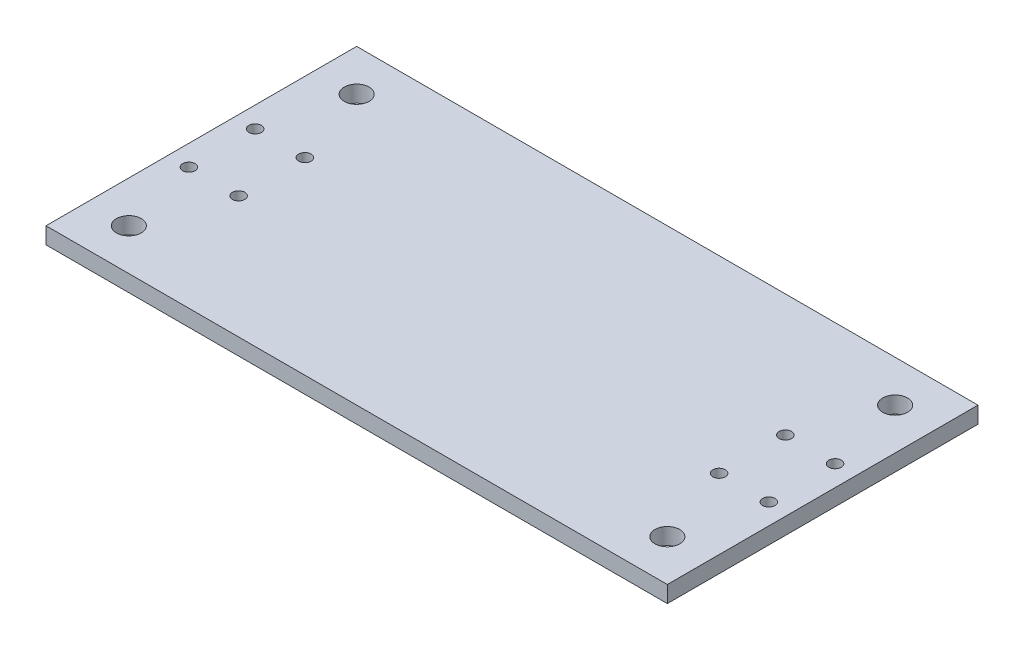
ISO-10303-21;
HEADER;
FILE_DESCRIPTION(('STEP AP214'),'2;1');
FILE_NAME('part.step','',(''),(''),'','','');
FILE_SCHEMA(('AUTOMOTIVE_DESIGN { 1 0 10303 214 1 1 1 1 }'));
ENDSEC;
DATA;
#1=APPLICATION_CONTEXT('core data for automotive mechanical design processes');
#2=APPLICATION_PROTOCOL_DEFINITION('international standard','automotive_design',2000,#1);
#3=PRODUCT_CONTEXT('',#1,'mechanical');
#4=PRODUCT('Part','Part','',(#3));
#5=PRODUCT_RELATED_PRODUCT_CATEGORY('part','',(#4));
#6=PRODUCT_DEFINITION_FORMATION('','',#4);
#7=PRODUCT_DEFINITION_CONTEXT('part definition',#1,'design');
#8=PRODUCT_DEFINITION('design','',#6,#7);
#9=PRODUCT_DEFINITION_SHAPE('','',#8);
#10=(LENGTH_UNIT() NAMED_UNIT(*) SI_UNIT(.MILLI.,.METRE.));
#11=(NAMED_UNIT(*) PLANE_ANGLE_UNIT() SI_UNIT($,.RADIAN.));
#12=(NAMED_UNIT(*) SI_UNIT($,.STERADIAN.) SOLID_ANGLE_UNIT());
#13=UNCERTAINTY_MEASURE_WITH_UNIT(LENGTH_MEASURE(1.E-05),#10,'distance_accuracy_value','');
#14=(GEOMETRIC_REPRESENTATION_CONTEXT(3) GLOBAL_UNCERTAINTY_ASSIGNED_CONTEXT((#13)) GLOBAL_UNIT_ASSIGNED_CONTEXT((#10,
#11,#12)) REPRESENTATION_CONTEXT('',''));
#15=CARTESIAN_POINT('',(0.,0.,0.));
#16=DIRECTION('',(0.,0.,1.));
#17=DIRECTION('',(1.,0.,0.));
#18=AXIS2_PLACEMENT_3D('',#15,#16,#17);
#19=CARTESIAN_POINT('',(0.,4.,0.));
#20=DIRECTION('',(0.,-1.,0.));
#21=DIRECTION('',(0.,0.,-1.));
#22=AXIS2_PLACEMENT_3D('',#19,#20,#21);
#23=PLANE('',#22);
#24=DIRECTION('',(0.,0.,-1.));
#25=VECTOR('',#24,1.);
#26=CARTESIAN_POINT('',(75.,4.,37.5));
#27=LINE('',#26,#25);
#28=CARTESIAN_POINT('',(75.,4.,37.5));
#29=VERTEX_POINT('',#28);
#30=CARTESIAN_POINT('',(75.,4.,-37.5));
#31=VERTEX_POINT('',#30);
#32=EDGE_CURVE('E92',#29,#31,#27,.T.);
#33=ORIENTED_EDGE('',*,*,#32,.T.);
#34=DIRECTION('',(-1.,0.,0.));
#35=VECTOR('',#34,1.);
#36=CARTESIAN_POINT('',(-75.,4.,-37.5));
#37=LINE('',#36,#35);
#38=CARTESIAN_POINT('',(-75.,4.,-37.5));
#39=VERTEX_POINT('',#38);
#40=EDGE_CURVE('E87',#31,#39,#37,.T.);
#41=ORIENTED_EDGE('',*,*,#40,.T.);
#42=DIRECTION('',(0.,0.,1.));
#43=VECTOR('',#42,1.);
#44=CARTESIAN_POINT('',(-75.,4.,37.5));
#45=LINE('',#44,#43);
#46=CARTESIAN_POINT('',(-75.,4.,37.5));
#47=VERTEX_POINT('',#46);
#48=EDGE_CURVE('E90',#39,#47,#45,.T.);
#49=ORIENTED_EDGE('',*,*,#48,.T.);
#50=DIRECTION('',(1.,0.,0.));
#51=VECTOR('',#50,1.);
#52=CARTESIAN_POINT('',(-75.,4.,37.5));
#53=LINE('',#52,#51);
#54=EDGE_CURVE('E57',#47,#29,#53,.T.);
#55=ORIENTED_EDGE('',*,*,#54,.T.);
#56=EDGE_LOOP('',(#33,#41,#49,#55));
#57=FACE_BOUND('',#56,.T.);
#58=CARTESIAN_POINT('',(-65.,4.,-27.5));
#59=DIRECTION('',(0.,1.,0.));
#60=DIRECTION('',(0.,0.,1.));
#61=AXIS2_PLACEMENT_3D('',#58,#59,#60);
#62=CIRCLE('',#61,3.);
#63=CARTESIAN_POINT('',(-65.,4.,-24.5));
#64=VERTEX_POINT('',#63);
#65=EDGE_CURVE('E112',#64,#64,#62,.T.);
#66=ORIENTED_EDGE('',*,*,#65,.F.);
#67=EDGE_LOOP('',(#66));
#68=FACE_BOUND('',#67,.T.);
#69=CARTESIAN_POINT('',(-70.,4.,-8.));
#70=DIRECTION('',(0.,1.,0.));
#71=DIRECTION('',(0.,0.,1.));
#72=AXIS2_PLACEMENT_3D('',#69,#70,#71);
#73=CIRCLE('',#72,1.5);
#74=CARTESIAN_POINT('',(-70.,4.,-6.5));
#75=VERTEX_POINT('',#74);
#76=EDGE_CURVE('E134',#75,#75,#73,.T.);
#77=ORIENTED_EDGE('',*,*,#76,.F.);
#78=EDGE_LOOP('',(#77));
#79=FACE_BOUND('',#78,.T.);
#80=CARTESIAN_POINT('',(-70.,4.,7.99999999999999));
#81=DIRECTION('',(0.,1.,0.));
#82=DIRECTION('',(0.,0.,-1.));
#83=AXIS2_PLACEMENT_3D('',#80,#81,#82);
#84=CIRCLE('',#83,1.5);
#85=CARTESIAN_POINT('',(-70.,4.,6.49999999999999));
#86=VERTEX_POINT('',#85);
#87=EDGE_CURVE('E142',#86,#86,#84,.T.);
#88=ORIENTED_EDGE('',*,*,#87,.F.);
#89=EDGE_LOOP('',(#88));
#90=FACE_BOUND('',#89,.T.);
#91=CARTESIAN_POINT('',(-58.,4.,7.99999999999999));
#92=DIRECTION('',(0.,1.,0.));
#93=DIRECTION('',(0.,0.,1.));
#94=AXIS2_PLACEMENT_3D('',#91,#92,#93);
#95=CIRCLE('',#94,1.5);
#96=CARTESIAN_POINT('',(-58.,4.,9.49999999999998));
#97=VERTEX_POINT('',#96);
#98=EDGE_CURVE('E150',#97,#97,#95,.T.);
#99=ORIENTED_EDGE('',*,*,#98,.F.);
#100=EDGE_LOOP('',(#99));
#101=FACE_BOUND('',#100,.T.);
#102=CARTESIAN_POINT('',(-58.,4.,-8.));
#103=DIRECTION('',(0.,1.,0.));
#104=DIRECTION('',(0.,0.,-1.));
#105=AXIS2_PLACEMENT_3D('',#102,#103,#104);
#106=CIRCLE('',#105,1.5);
#107=CARTESIAN_POINT('',(-58.,4.,-9.5));
#108=VERTEX_POINT('',#107);
#109=EDGE_CURVE('E158',#108,#108,#106,.T.);
#110=ORIENTED_EDGE('',*,*,#109,.F.);
#111=EDGE_LOOP('',(#110));
#112=FACE_BOUND('',#111,.T.);
#113=CARTESIAN_POINT('',(58.,4.,7.99999999999999));
#114=DIRECTION('',(0.,1.,0.));
#115=DIRECTION('',(0.,0.,-1.));
#116=AXIS2_PLACEMENT_3D('',#113,#114,#115);
#117=CIRCLE('',#116,1.5);
#118=CARTESIAN_POINT('',(58.,4.,6.49999999999999));
#119=VERTEX_POINT('',#118);
#120=EDGE_CURVE('E166',#119,#119,#117,.T.);
#121=ORIENTED_EDGE('',*,*,#120,.F.);
#122=EDGE_LOOP('',(#121));
#123=FACE_BOUND('',#122,.T.);
#124=CARTESIAN_POINT('',(70.,4.,7.99999999999999));
#125=DIRECTION('',(0.,1.,0.));
#126=DIRECTION('',(0.,0.,1.));
#127=AXIS2_PLACEMENT_3D('',#124,#125,#126);
#128=CIRCLE('',#127,1.5);
#129=CARTESIAN_POINT('',(70.,4.,9.49999999999998));
#130=VERTEX_POINT('',#129);
#131=EDGE_CURVE('E174',#130,#130,#128,.T.);
#132=ORIENTED_EDGE('',*,*,#131,.F.);
#133=EDGE_LOOP('',(#132));
#134=FACE_BOUND('',#133,.T.);
#135=CARTESIAN_POINT('',(58.,4.,-8.));
#136=DIRECTION('',(0.,1.,0.));
#137=DIRECTION('',(0.,0.,1.));
#138=AXIS2_PLACEMENT_3D('',#135,#136,#137);
#139=CIRCLE('',#138,1.5);
#140=CARTESIAN_POINT('',(58.,4.,-6.5));
#141=VERTEX_POINT('',#140);
#142=EDGE_CURVE('E182',#141,#141,#139,.T.);
#143=ORIENTED_EDGE('',*,*,#142,.F.);
#144=EDGE_LOOP('',(#143));
#145=FACE_BOUND('',#144,.T.);
#146=CARTESIAN_POINT('',(70.,4.,-8.));
#147=DIRECTION('',(0.,1.,0.));
#148=DIRECTION('',(0.,0.,-1.));
#149=AXIS2_PLACEMENT_3D('',#146,#147,#148);
#150=CIRCLE('',#149,1.5);
#151=CARTESIAN_POINT('',(70.,4.,-9.5));
#152=VERTEX_POINT('',#151);
#153=EDGE_CURVE('E190',#152,#152,#150,.T.);
#154=ORIENTED_EDGE('',*,*,#153,.F.);
#155=EDGE_LOOP('',(#154));
#156=FACE_BOUND('',#155,.T.);
#157=CARTESIAN_POINT('',(65.,4.,-27.5));
#158=DIRECTION('',(0.,1.,0.));
#159=DIRECTION('',(0.,0.,-1.));
#160=AXIS2_PLACEMENT_3D('',#157,#158,#159);
#161=CIRCLE('',#160,3.00000000000001);
#162=CARTESIAN_POINT('',(65.,4.,-30.5));
#163=VERTEX_POINT('',#162);
#164=EDGE_CURVE('E198',#163,#163,#161,.T.);
#165=ORIENTED_EDGE('',*,*,#164,.F.);
#166=EDGE_LOOP('',(#165));
#167=FACE_BOUND('',#166,.T.);
#168=CARTESIAN_POINT('',(-65.,4.,27.5));
#169=DIRECTION('',(0.,1.,0.));
#170=DIRECTION('',(0.,0.,-1.));
#171=AXIS2_PLACEMENT_3D('',#168,#169,#170);
#172=CIRCLE('',#171,3.);
#173=CARTESIAN_POINT('',(-65.,4.,24.5));
#174=VERTEX_POINT('',#173);
#175=EDGE_CURVE('E206',#174,#174,#172,.T.);
#176=ORIENTED_EDGE('',*,*,#175,.F.);
#177=EDGE_LOOP('',(#176));
#178=FACE_BOUND('',#177,.T.);
#179=CARTESIAN_POINT('',(65.,4.,27.5));
#180=DIRECTION('',(0.,1.,0.));
#181=DIRECTION('',(0.,0.,1.));
#182=AXIS2_PLACEMENT_3D('',#179,#180,#181);
#183=CIRCLE('',#182,3.00000000000001);
#184=CARTESIAN_POINT('',(65.,4.,30.5));
#185=VERTEX_POINT('',#184);
#186=EDGE_CURVE('E214',#185,#185,#183,.T.);
#187=ORIENTED_EDGE('',*,*,#186,.F.);
#188=EDGE_LOOP('',(#187));
#189=FACE_BOUND('',#188,.T.);
#190=ADVANCED_FACE('F39',(#57,#68,#79,#90,#101,#112,#123,#134,#145,#156,#167,#178,#189),#23,.F.);
#191=CARTESIAN_POINT('',(0.,0.,0.));
#192=DIRECTION('',(0.,-1.,0.));
#193=DIRECTION('',(0.,0.,-1.));
#194=AXIS2_PLACEMENT_3D('',#191,#192,#193);
#195=PLANE('',#194);
#196=CARTESIAN_POINT('',(-65.,0.,27.5));
#197=DIRECTION('',(0.,1.,0.));
#198=DIRECTION('',(0.,0.,-1.));
#199=AXIS2_PLACEMENT_3D('',#196,#197,#198);
#200=CIRCLE('',#199,3.);
#201=CARTESIAN_POINT('',(-65.,0.,24.5));
#202=VERTEX_POINT('',#201);
#203=EDGE_CURVE('E210',#202,#202,#200,.T.);
#204=ORIENTED_EDGE('',*,*,#203,.T.);
#205=EDGE_LOOP('',(#204));
#206=FACE_BOUND('',#205,.T.);
#207=CARTESIAN_POINT('',(70.,0.,-8.));
#208=DIRECTION('',(0.,1.,0.));
#209=DIRECTION('',(0.,0.,-1.));
#210=AXIS2_PLACEMENT_3D('',#207,#208,#209);
#211=CIRCLE('',#210,1.5);
#212=CARTESIAN_POINT('',(70.,0.,-9.5));
#213=VERTEX_POINT('',#212);
#214=EDGE_CURVE('E194',#213,#213,#211,.T.);
#215=ORIENTED_EDGE('',*,*,#214,.T.);
#216=EDGE_LOOP('',(#215));
#217=FACE_BOUND('',#216,.T.);
#218=CARTESIAN_POINT('',(70.,0.,7.99999999999999));
#219=DIRECTION('',(0.,1.,0.));
#220=DIRECTION('',(0.,0.,1.));
#221=AXIS2_PLACEMENT_3D('',#218,#219,#220);
#222=CIRCLE('',#221,1.5);
#223=CARTESIAN_POINT('',(70.,0.,9.49999999999998));
#224=VERTEX_POINT('',#223);
#225=EDGE_CURVE('E178',#224,#224,#222,.T.);
#226=ORIENTED_EDGE('',*,*,#225,.T.);
#227=EDGE_LOOP('',(#226));
#228=FACE_BOUND('',#227,.T.);
#229=CARTESIAN_POINT('',(-58.,0.,-8.));
#230=DIRECTION('',(0.,1.,0.));
#231=DIRECTION('',(0.,0.,-1.));
#232=AXIS2_PLACEMENT_3D('',#229,#230,#231);
#233=CIRCLE('',#232,1.5);
#234=CARTESIAN_POINT('',(-58.,0.,-9.5));
#235=VERTEX_POINT('',#234);
#236=EDGE_CURVE('E162',#235,#235,#233,.T.);
#237=ORIENTED_EDGE('',*,*,#236,.T.);
#238=EDGE_LOOP('',(#237));
#239=FACE_BOUND('',#238,.T.);
#240=CARTESIAN_POINT('',(-70.,0.,7.99999999999999));
#241=DIRECTION('',(0.,1.,0.));
#242=DIRECTION('',(0.,0.,-1.));
#243=AXIS2_PLACEMENT_3D('',#240,#241,#242);
#244=CIRCLE('',#243,1.5);
#245=CARTESIAN_POINT('',(-70.,0.,6.49999999999999));
#246=VERTEX_POINT('',#245);
#247=EDGE_CURVE('E146',#246,#246,#244,.T.);
#248=ORIENTED_EDGE('',*,*,#247,.T.);
#249=EDGE_LOOP('',(#248));
#250=FACE_BOUND('',#249,.T.);
#251=CARTESIAN_POINT('',(-65.,0.,-27.5));
#252=DIRECTION('',(0.,1.,0.));
#253=DIRECTION('',(0.,0.,1.));
#254=AXIS2_PLACEMENT_3D('',#251,#252,#253);
#255=CIRCLE('',#254,3.);
#256=CARTESIAN_POINT('',(-65.,0.,-24.5));
#257=VERTEX_POINT('',#256);
#258=EDGE_CURVE('E130',#257,#257,#255,.T.);
#259=ORIENTED_EDGE('',*,*,#258,.T.);
#260=EDGE_LOOP('',(#259));
#261=FACE_BOUND('',#260,.T.);
#262=DIRECTION('',(0.,0.,-1.));
#263=VECTOR('',#262,1.);
#264=CARTESIAN_POINT('',(75.,0.,37.5));
#265=LINE('',#264,#263);
#266=CARTESIAN_POINT('',(75.,0.,37.5));
#267=VERTEX_POINT('',#266);
#268=CARTESIAN_POINT('',(75.,0.,-37.5));
#269=VERTEX_POINT('',#268);
#270=EDGE_CURVE('E108',#267,#269,#265,.T.);
#271=ORIENTED_EDGE('',*,*,#270,.F.);
#272=DIRECTION('',(1.,0.,0.));
#273=VECTOR('',#272,1.);
#274=CARTESIAN_POINT('',(-75.,0.,37.5));
#275=LINE('',#274,#273);
#276=CARTESIAN_POINT('',(-75.,0.,37.5));
#277=VERTEX_POINT('',#276);
#278=EDGE_CURVE('E80',#277,#267,#275,.T.);
#279=ORIENTED_EDGE('',*,*,#278,.F.);
#280=DIRECTION('',(0.,0.,1.));
#281=VECTOR('',#280,1.);
#282=CARTESIAN_POINT('',(-75.,0.,37.5));
#283=LINE('',#282,#281);
#284=CARTESIAN_POINT('',(-75.,0.,-37.5));
#285=VERTEX_POINT('',#284);
#286=EDGE_CURVE('E74',#285,#277,#283,.T.);
#287=ORIENTED_EDGE('',*,*,#286,.F.);
#288=DIRECTION('',(-1.,0.,0.));
#289=VECTOR('',#288,1.);
#290=CARTESIAN_POINT('',(-75.,0.,-37.5));
#291=LINE('',#290,#289);
#292=EDGE_CURVE('E97',#269,#285,#291,.T.);
#293=ORIENTED_EDGE('',*,*,#292,.F.);
#294=EDGE_LOOP('',(#271,#279,#287,#293));
#295=FACE_BOUND('',#294,.T.);
#296=CARTESIAN_POINT('',(-70.,0.,-8.));
#297=DIRECTION('',(0.,1.,0.));
#298=DIRECTION('',(0.,0.,1.));
#299=AXIS2_PLACEMENT_3D('',#296,#297,#298);
#300=CIRCLE('',#299,1.5);
#301=CARTESIAN_POINT('',(-70.,0.,-6.5));
#302=VERTEX_POINT('',#301);
#303=EDGE_CURVE('E138',#302,#302,#300,.T.);
#304=ORIENTED_EDGE('',*,*,#303,.T.);
#305=EDGE_LOOP('',(#304));
#306=FACE_BOUND('',#305,.T.);
#307=CARTESIAN_POINT('',(-58.,0.,7.99999999999999));
#308=DIRECTION('',(0.,1.,0.));
#309=DIRECTION('',(0.,0.,1.));
#310=AXIS2_PLACEMENT_3D('',#307,#308,#309);
#311=CIRCLE('',#310,1.5);
#312=CARTESIAN_POINT('',(-58.,0.,9.49999999999998));
#313=VERTEX_POINT('',#312);
#314=EDGE_CURVE('E154',#313,#313,#311,.T.);
#315=ORIENTED_EDGE('',*,*,#314,.T.);
#316=EDGE_LOOP('',(#315));
#317=FACE_BOUND('',#316,.T.);
#318=CARTESIAN_POINT('',(58.,0.,7.99999999999999));
#319=DIRECTION('',(0.,1.,0.));
#320=DIRECTION('',(0.,0.,-1.));
#321=AXIS2_PLACEMENT_3D('',#318,#319,#320);
#322=CIRCLE('',#321,1.5);
#323=CARTESIAN_POINT('',(58.,0.,6.49999999999999));
#324=VERTEX_POINT('',#323);
#325=EDGE_CURVE('E170',#324,#324,#322,.T.);
#326=ORIENTED_EDGE('',*,*,#325,.T.);
#327=EDGE_LOOP('',(#326));
#328=FACE_BOUND('',#327,.T.);
#329=CARTESIAN_POINT('',(58.,0.,-8.));
#330=DIRECTION('',(0.,1.,0.));
#331=DIRECTION('',(0.,0.,1.));
#332=AXIS2_PLACEMENT_3D('',#329,#330,#331);
#333=CIRCLE('',#332,1.5);
#334=CARTESIAN_POINT('',(58.,0.,-6.5));
#335=VERTEX_POINT('',#334);
#336=EDGE_CURVE('E186',#335,#335,#333,.T.);
#337=ORIENTED_EDGE('',*,*,#336,.T.);
#338=EDGE_LOOP('',(#337));
#339=FACE_BOUND('',#338,.T.);
#340=CARTESIAN_POINT('',(65.,0.,-27.5));
#341=DIRECTION('',(0.,1.,0.));
#342=DIRECTION('',(0.,0.,-1.));
#343=AXIS2_PLACEMENT_3D('',#340,#341,#342);
#344=CIRCLE('',#343,3.00000000000001);
#345=CARTESIAN_POINT('',(65.,0.,-30.5));
#346=VERTEX_POINT('',#345);
#347=EDGE_CURVE('E202',#346,#346,#344,.T.);
#348=ORIENTED_EDGE('',*,*,#347,.T.);
#349=EDGE_LOOP('',(#348));
#350=FACE_BOUND('',#349,.T.);
#351=CARTESIAN_POINT('',(65.,0.,27.5));
#352=DIRECTION('',(0.,1.,0.));
#353=DIRECTION('',(0.,0.,1.));
#354=AXIS2_PLACEMENT_3D('',#351,#352,#353);
#355=CIRCLE('',#354,3.00000000000001);
#356=CARTESIAN_POINT('',(65.,0.,30.5));
#357=VERTEX_POINT('',#356);
#358=EDGE_CURVE('E218',#357,#357,#355,.T.);
#359=ORIENTED_EDGE('',*,*,#358,.T.);
#360=EDGE_LOOP('',(#359));
#361=FACE_BOUND('',#360,.T.);
#362=ADVANCED_FACE('F125',(#206,#217,#228,#239,#250,#261,#295,#306,#317,#328,#339,#350,#361),
#195,.T.);
#363=CARTESIAN_POINT('',(75.,4.,37.5));
#364=DIRECTION('',(-1.,0.,0.));
#365=DIRECTION('',(0.,0.,1.));
#366=AXIS2_PLACEMENT_3D('',#363,#364,#365);
#367=PLANE('',#366);
#368=ORIENTED_EDGE('',*,*,#270,.T.);
#369=DIRECTION('',(0.,-1.,0.));
#370=VECTOR('',#369,1.);
#371=CARTESIAN_POINT('',(75.,4.,-37.5));
#372=LINE('',#371,#370);
#373=EDGE_CURVE('E11',#31,#269,#372,.T.);
#374=ORIENTED_EDGE('',*,*,#373,.F.);
#375=ORIENTED_EDGE('',*,*,#32,.F.);
#376=DIRECTION('',(0.,-1.,0.));
#377=VECTOR('',#376,1.);
#378=CARTESIAN_POINT('',(75.,4.,37.5));
#379=LINE('',#378,#377);
#380=EDGE_CURVE('E104',#29,#267,#379,.T.);
#381=ORIENTED_EDGE('',*,*,#380,.T.);
#382=EDGE_LOOP('',(#368,#374,#375,#381));
#383=FACE_BOUND('',#382,.T.);
#384=ADVANCED_FACE('F41',(#383),#367,.F.);
#385=CARTESIAN_POINT('',(-75.,4.,-37.5));
#386=DIRECTION('',(0.,0.,1.));
#387=DIRECTION('',(1.,0.,0.));
#388=AXIS2_PLACEMENT_3D('',#385,#386,#387);
#389=PLANE('',#388);
#390=ORIENTED_EDGE('',*,*,#292,.T.);
#391=DIRECTION('',(0.,-1.,0.));
#392=VECTOR('',#391,1.);
#393=CARTESIAN_POINT('',(-75.,4.,-37.5));
#394=LINE('',#393,#392);
#395=EDGE_CURVE('E49',#39,#285,#394,.T.);
#396=ORIENTED_EDGE('',*,*,#395,.F.);
#397=ORIENTED_EDGE('',*,*,#40,.F.);
#398=ORIENTED_EDGE('',*,*,#373,.T.);
#399=EDGE_LOOP('',(#390,#396,#397,#398));
#400=FACE_BOUND('',#399,.T.);
#401=ADVANCED_FACE('F96',(#400),#389,.F.);
#402=CARTESIAN_POINT('',(-75.,4.,37.5));
#403=DIRECTION('',(1.,0.,0.));
#404=DIRECTION('',(0.,0.,-1.));
#405=AXIS2_PLACEMENT_3D('',#402,#403,#404);
#406=PLANE('',#405);
#407=ORIENTED_EDGE('',*,*,#286,.T.);
#408=DIRECTION('',(0.,-1.,0.));
#409=VECTOR('',#408,1.);
#410=CARTESIAN_POINT('',(-75.,4.,37.5));
#411=LINE('',#410,#409);
#412=EDGE_CURVE('E99',#47,#277,#411,.T.);
#413=ORIENTED_EDGE('',*,*,#412,.F.);
#414=ORIENTED_EDGE('',*,*,#48,.F.);
#415=ORIENTED_EDGE('',*,*,#395,.T.);
#416=EDGE_LOOP('',(#407,#413,#414,#415));
#417=FACE_BOUND('',#416,.T.);
#418=ADVANCED_FACE('F100',(#417),#406,.F.);
#419=CARTESIAN_POINT('',(-75.,4.,37.5));
#420=DIRECTION('',(0.,0.,-1.));
#421=DIRECTION('',(-1.,0.,0.));
#422=AXIS2_PLACEMENT_3D('',#419,#420,#421);
#423=PLANE('',#422);
#424=ORIENTED_EDGE('',*,*,#278,.T.);
#425=ORIENTED_EDGE('',*,*,#380,.F.);
#426=ORIENTED_EDGE('',*,*,#54,.F.);
#427=ORIENTED_EDGE('',*,*,#412,.T.);
#428=EDGE_LOOP('',(#424,#425,#426,#427));
#429=FACE_BOUND('',#428,.T.);
#430=ADVANCED_FACE('F122',(#429),#423,.F.);
#431=CARTESIAN_POINT('',(-65.,4.,-27.5));
#432=DIRECTION('',(0.,-1.,0.));
#433=DIRECTION('',(0.,0.,-1.));
#434=AXIS2_PLACEMENT_3D('',#431,#432,#433);
#435=CYLINDRICAL_SURFACE('',#434,3.);
#436=ORIENTED_EDGE('',*,*,#65,.T.);
#437=EDGE_LOOP('',(#436));
#438=FACE_BOUND('',#437,.T.);
#439=ORIENTED_EDGE('',*,*,#258,.F.);
#440=EDGE_LOOP('',(#439));
#441=FACE_BOUND('',#440,.T.);
#442=ADVANCED_FACE('F237',(#438,#441),#435,.F.);
#443=CARTESIAN_POINT('',(-70.,4.,-8.));
#444=DIRECTION('',(0.,-1.,0.));
#445=DIRECTION('',(0.,0.,-1.));
#446=AXIS2_PLACEMENT_3D('',#443,#444,#445);
#447=CYLINDRICAL_SURFACE('',#446,1.5);
#448=ORIENTED_EDGE('',*,*,#76,.T.);
#449=EDGE_LOOP('',(#448));
#450=FACE_BOUND('',#449,.T.);
#451=ORIENTED_EDGE('',*,*,#303,.F.);
#452=EDGE_LOOP('',(#451));
#453=FACE_BOUND('',#452,.T.);
#454=ADVANCED_FACE('F283',(#450,#453),#447,.F.);
#455=CARTESIAN_POINT('',(-70.,4.,7.99999999999999));
#456=DIRECTION('',(0.,-1.,0.));
#457=DIRECTION('',(0.,0.,-1.));
#458=AXIS2_PLACEMENT_3D('',#455,#456,#457);
#459=CYLINDRICAL_SURFACE('',#458,1.5);
#460=ORIENTED_EDGE('',*,*,#87,.T.);
#461=EDGE_LOOP('',(#460));
#462=FACE_BOUND('',#461,.T.);
#463=ORIENTED_EDGE('',*,*,#247,.F.);
#464=EDGE_LOOP('',(#463));
#465=FACE_BOUND('',#464,.T.);
#466=ADVANCED_FACE('F291',(#462,#465),#459,.F.);
#467=CARTESIAN_POINT('',(-58.,4.,7.99999999999999));
#468=DIRECTION('',(0.,-1.,0.));
#469=DIRECTION('',(0.,0.,-1.));
#470=AXIS2_PLACEMENT_3D('',#467,#468,#469);
#471=CYLINDRICAL_SURFACE('',#470,1.5);
#472=ORIENTED_EDGE('',*,*,#98,.T.);
#473=EDGE_LOOP('',(#472));
#474=FACE_BOUND('',#473,.T.);
#475=ORIENTED_EDGE('',*,*,#314,.F.);
#476=EDGE_LOOP('',(#475));
#477=FACE_BOUND('',#476,.T.);
#478=ADVANCED_FACE('F299',(#474,#477),#471,.F.);
#479=CARTESIAN_POINT('',(-58.,4.,-8.));
#480=DIRECTION('',(0.,-1.,0.));
#481=DIRECTION('',(0.,0.,-1.));
#482=AXIS2_PLACEMENT_3D('',#479,#480,#481);
#483=CYLINDRICAL_SURFACE('',#482,1.5);
#484=ORIENTED_EDGE('',*,*,#109,.T.);
#485=EDGE_LOOP('',(#484));
#486=FACE_BOUND('',#485,.T.);
#487=ORIENTED_EDGE('',*,*,#236,.F.);
#488=EDGE_LOOP('',(#487));
#489=FACE_BOUND('',#488,.T.);
#490=ADVANCED_FACE('F308',(#486,#489),#483,.F.);
#491=CARTESIAN_POINT('',(58.,4.,7.99999999999999));
#492=DIRECTION('',(0.,-1.,0.));
#493=DIRECTION('',(0.,0.,-1.));
#494=AXIS2_PLACEMENT_3D('',#491,#492,#493);
#495=CYLINDRICAL_SURFACE('',#494,1.5);
#496=ORIENTED_EDGE('',*,*,#120,.T.);
#497=EDGE_LOOP('',(#496));
#498=FACE_BOUND('',#497,.T.);
#499=ORIENTED_EDGE('',*,*,#325,.F.);
#500=EDGE_LOOP('',(#499));
#501=FACE_BOUND('',#500,.T.);
#502=ADVANCED_FACE('F317',(#498,#501),#495,.F.);
#503=CARTESIAN_POINT('',(70.,4.,7.99999999999999));
#504=DIRECTION('',(0.,-1.,0.));
#505=DIRECTION('',(0.,0.,-1.));
#506=AXIS2_PLACEMENT_3D('',#503,#504,#505);
#507=CYLINDRICAL_SURFACE('',#506,1.5);
#508=ORIENTED_EDGE('',*,*,#131,.T.);
#509=EDGE_LOOP('',(#508));
#510=FACE_BOUND('',#509,.T.);
#511=ORIENTED_EDGE('',*,*,#225,.F.);
#512=EDGE_LOOP('',(#511));
#513=FACE_BOUND('',#512,.T.);
#514=ADVANCED_FACE('F326',(#510,#513),#507,.F.);
#515=CARTESIAN_POINT('',(58.,4.,-8.));
#516=DIRECTION('',(0.,-1.,0.));
#517=DIRECTION('',(0.,0.,-1.));
#518=AXIS2_PLACEMENT_3D('',#515,#516,#517);
#519=CYLINDRICAL_SURFACE('',#518,1.5);
#520=ORIENTED_EDGE('',*,*,#142,.T.);
#521=EDGE_LOOP('',(#520));
#522=FACE_BOUND('',#521,.T.);
#523=ORIENTED_EDGE('',*,*,#336,.F.);
#524=EDGE_LOOP('',(#523));
#525=FACE_BOUND('',#524,.T.);
#526=ADVANCED_FACE('F335',(#522,#525),#519,.F.);
#527=CARTESIAN_POINT('',(70.,4.,-8.));
#528=DIRECTION('',(0.,-1.,0.));
#529=DIRECTION('',(0.,0.,-1.));
#530=AXIS2_PLACEMENT_3D('',#527,#528,#529);
#531=CYLINDRICAL_SURFACE('',#530,1.5);
#532=ORIENTED_EDGE('',*,*,#153,.T.);
#533=EDGE_LOOP('',(#532));
#534=FACE_BOUND('',#533,.T.);
#535=ORIENTED_EDGE('',*,*,#214,.F.);
#536=EDGE_LOOP('',(#535));
#537=FACE_BOUND('',#536,.T.);
#538=ADVANCED_FACE('F344',(#534,#537),#531,.F.);
#539=CARTESIAN_POINT('',(65.,4.,-27.5));
#540=DIRECTION('',(0.,-1.,0.));
#541=DIRECTION('',(0.,0.,-1.));
#542=AXIS2_PLACEMENT_3D('',#539,#540,#541);
#543=CYLINDRICAL_SURFACE('',#542,3.00000000000001);
#544=ORIENTED_EDGE('',*,*,#164,.T.);
#545=EDGE_LOOP('',(#544));
#546=FACE_BOUND('',#545,.T.);
#547=ORIENTED_EDGE('',*,*,#347,.F.);
#548=EDGE_LOOP('',(#547));
#549=FACE_BOUND('',#548,.T.);
#550=ADVANCED_FACE('F353',(#546,#549),#543,.F.);
#551=CARTESIAN_POINT('',(-65.,4.,27.5));
#552=DIRECTION('',(0.,-1.,0.));
#553=DIRECTION('',(0.,0.,-1.));
#554=AXIS2_PLACEMENT_3D('',#551,#552,#553);
#555=CYLINDRICAL_SURFACE('',#554,3.);
#556=ORIENTED_EDGE('',*,*,#175,.T.);
#557=EDGE_LOOP('',(#556));
#558=FACE_BOUND('',#557,.T.);
#559=ORIENTED_EDGE('',*,*,#203,.F.);
#560=EDGE_LOOP('',(#559));
#561=FACE_BOUND('',#560,.T.);
#562=ADVANCED_FACE('F362',(#558,#561),#555,.F.);
#563=CARTESIAN_POINT('',(65.,4.,27.5));
#564=DIRECTION('',(0.,-1.,0.));
#565=DIRECTION('',(0.,0.,-1.));
#566=AXIS2_PLACEMENT_3D('',#563,#564,#565);
#567=CYLINDRICAL_SURFACE('',#566,3.00000000000001);
#568=ORIENTED_EDGE('',*,*,#186,.T.);
#569=EDGE_LOOP('',(#568));
#570=FACE_BOUND('',#569,.T.);
#571=ORIENTED_EDGE('',*,*,#358,.F.);
#572=EDGE_LOOP('',(#571));
#573=FACE_BOUND('',#572,.T.);
#574=ADVANCED_FACE('F226',(#570,#573),#567,.F.);
#575=CLOSED_SHELL('',(#190,#362,#384,#401,#418,#430,#442,#454,#466,#478,#490,#502,#514,#526,
#538,#550,#562,#574));
#576=MANIFOLD_SOLID_BREP('B2',#575);
#577=ADVANCED_BREP_SHAPE_REPRESENTATION('',(#18,#576),#14);
#578=SHAPE_DEFINITION_REPRESENTATION(#9,#577);
ENDSEC;
END-ISO-10303-21;
